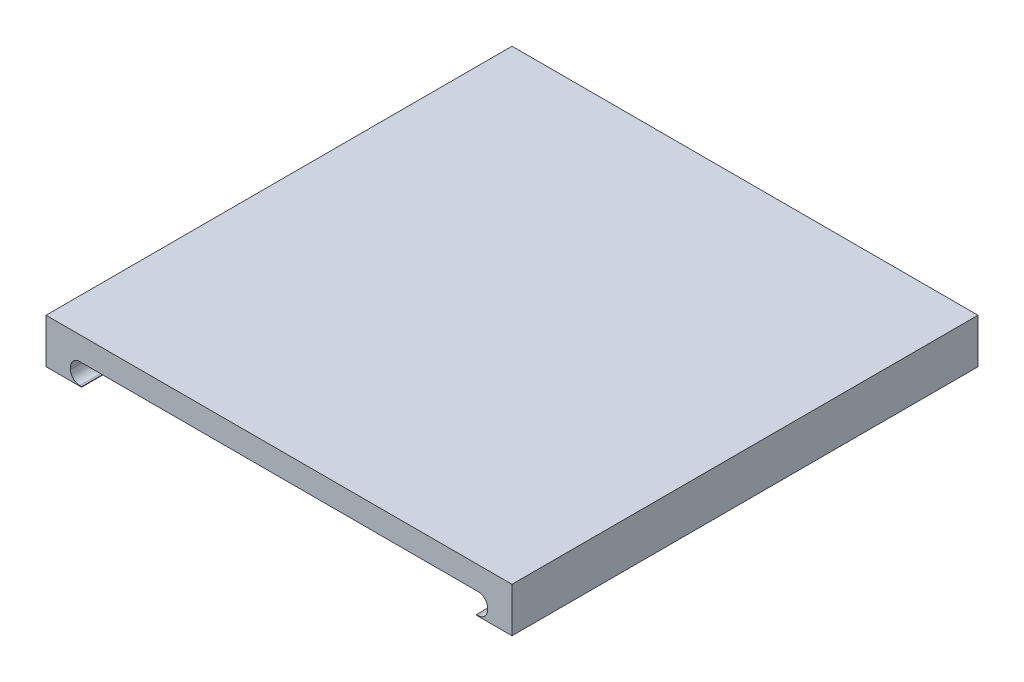
ISO-10303-21;
HEADER;
FILE_DESCRIPTION(('STEP AP214'),'2;1');
FILE_NAME('part.step','',(''),(''),'','','');
FILE_SCHEMA(('AUTOMOTIVE_DESIGN { 1 0 10303 214 1 1 1 1 }'));
ENDSEC;
DATA;
#1=APPLICATION_CONTEXT('core data for automotive mechanical design processes');
#2=APPLICATION_PROTOCOL_DEFINITION('international standard','automotive_design',2000,#1);
#3=PRODUCT_CONTEXT('',#1,'mechanical');
#4=PRODUCT('Part','Part','',(#3));
#5=PRODUCT_RELATED_PRODUCT_CATEGORY('part','',(#4));
#6=PRODUCT_DEFINITION_FORMATION('','',#4);
#7=PRODUCT_DEFINITION_CONTEXT('part definition',#1,'design');
#8=PRODUCT_DEFINITION('design','',#6,#7);
#9=PRODUCT_DEFINITION_SHAPE('','',#8);
#10=(LENGTH_UNIT() NAMED_UNIT(*) SI_UNIT(.MILLI.,.METRE.));
#11=(NAMED_UNIT(*) PLANE_ANGLE_UNIT() SI_UNIT($,.RADIAN.));
#12=(NAMED_UNIT(*) SI_UNIT($,.STERADIAN.) SOLID_ANGLE_UNIT());
#13=UNCERTAINTY_MEASURE_WITH_UNIT(LENGTH_MEASURE(1.E-05),#10,'distance_accuracy_value','');
#14=(GEOMETRIC_REPRESENTATION_CONTEXT(3) GLOBAL_UNCERTAINTY_ASSIGNED_CONTEXT((#13)) GLOBAL_UNIT_ASSIGNED_CONTEXT((#10,
#11,#12)) REPRESENTATION_CONTEXT('',''));
#15=CARTESIAN_POINT('',(0.,0.,0.));
#16=DIRECTION('',(0.,0.,1.));
#17=DIRECTION('',(1.,0.,0.));
#18=AXIS2_PLACEMENT_3D('',#15,#16,#17);
#19=CARTESIAN_POINT('',(25.,5.,25.));
#20=DIRECTION('',(-1.,0.,0.));
#21=DIRECTION('',(0.,0.,1.));
#22=AXIS2_PLACEMENT_3D('',#19,#20,#21);
#23=PLANE('',#22);
#24=DIRECTION('',(0.,-1.,0.));
#25=VECTOR('',#24,1.);
#26=CARTESIAN_POINT('',(25.,5.,25.));
#27=LINE('',#26,#25);
#28=CARTESIAN_POINT('',(25.,5.,25.));
#29=VERTEX_POINT('',#28);
#30=CARTESIAN_POINT('',(25.,0.211754728396015,25.));
#31=VERTEX_POINT('',#30);
#32=EDGE_CURVE('E159',#29,#31,#27,.T.);
#33=ORIENTED_EDGE('',*,*,#32,.T.);
#34=DIRECTION('',(0.,0.,1.));
#35=VECTOR('',#34,1.);
#36=CARTESIAN_POINT('',(25.,0.211754728396015,-25.));
#37=LINE('',#36,#35);
#38=CARTESIAN_POINT('',(25.,0.211754728396015,-25.));
#39=VERTEX_POINT('',#38);
#40=EDGE_CURVE('E146',#39,#31,#37,.T.);
#41=ORIENTED_EDGE('',*,*,#40,.F.);
#42=DIRECTION('',(0.,-1.,0.));
#43=VECTOR('',#42,1.);
#44=CARTESIAN_POINT('',(25.,5.,-25.));
#45=LINE('',#44,#43);
#46=CARTESIAN_POINT('',(25.,5.,-25.));
#47=VERTEX_POINT('',#46);
#48=EDGE_CURVE('E157',#47,#39,#45,.T.);
#49=ORIENTED_EDGE('',*,*,#48,.F.);
#50=DIRECTION('',(0.,0.,-1.));
#51=VECTOR('',#50,1.);
#52=CARTESIAN_POINT('',(25.,5.,25.));
#53=LINE('',#52,#51);
#54=EDGE_CURVE('E262',#29,#47,#53,.T.);
#55=ORIENTED_EDGE('',*,*,#54,.F.);
#56=EDGE_LOOP('',(#33,#41,#49,#55));
#57=FACE_BOUND('',#56,.T.);
#58=ADVANCED_FACE('F33',(#57),#23,.F.);
#59=CARTESIAN_POINT('',(-25.,5.,-25.));
#60=DIRECTION('',(0.,0.,1.));
#61=DIRECTION('',(1.,0.,0.));
#62=AXIS2_PLACEMENT_3D('',#59,#60,#61);
#63=PLANE('',#62);
#64=ORIENTED_EDGE('',*,*,#48,.T.);
#65=DIRECTION('',(-1.,0.,0.));
#66=VECTOR('',#65,1.);
#67=CARTESIAN_POINT('',(21.182376975,0.211754728396015,-25.));
#68=LINE('',#67,#66);
#69=CARTESIAN_POINT('',(21.182376975,0.211754728396015,-25.));
#70=VERTEX_POINT('',#69);
#71=EDGE_CURVE('E143',#39,#70,#68,.T.);
#72=ORIENTED_EDGE('',*,*,#71,.T.);
#73=DIRECTION('',(0.,-1.,0.));
#74=VECTOR('',#73,1.);
#75=CARTESIAN_POINT('',(21.182376975,2.5,-25.));
#76=LINE('',#75,#74);
#77=CARTESIAN_POINT('',(21.182376975,0.27848903671504,-25.));
#78=VERTEX_POINT('',#77);
#79=EDGE_CURVE('E258',#78,#70,#76,.T.);
#80=ORIENTED_EDGE('',*,*,#79,.F.);
#81=DIRECTION('',(-1.,0.,0.));
#82=VECTOR('',#81,1.);
#83=CARTESIAN_POINT('',(21.182376975,0.27848903671504,-25.));
#84=LINE('',#83,#82);
#85=CARTESIAN_POINT('',(21.3710197890908,0.27848903671504,-25.));
#86=VERTEX_POINT('',#85);
#87=EDGE_CURVE('E246',#86,#78,#84,.T.);
#88=ORIENTED_EDGE('',*,*,#87,.F.);
#89=CARTESIAN_POINT('',(21.3710197890908,1.27848903671504,-25.));
#90=DIRECTION('',(0.,0.,1.));
#91=DIRECTION('',(1.,0.,0.));
#92=AXIS2_PLACEMENT_3D('',#89,#90,#91);
#93=CIRCLE('',#92,1.);
#94=CARTESIAN_POINT('',(22.3710197890908,1.27848903671504,-25.));
#95=VERTEX_POINT('',#94);
#96=EDGE_CURVE('E188',#86,#95,#93,.T.);
#97=ORIENTED_EDGE('',*,*,#96,.T.);
#98=DIRECTION('',(0.,-1.,0.));
#99=VECTOR('',#98,1.);
#100=CARTESIAN_POINT('',(22.3710197890908,2.5,-25.));
#101=LINE('',#100,#99);
#102=CARTESIAN_POINT('',(22.3710197890908,1.5,-25.));
#103=VERTEX_POINT('',#102);
#104=EDGE_CURVE('E236',#103,#95,#101,.T.);
#105=ORIENTED_EDGE('',*,*,#104,.F.);
#106=CARTESIAN_POINT('',(21.3710197890908,1.5,-25.));
#107=DIRECTION('',(0.,0.,1.));
#108=DIRECTION('',(1.,0.,0.));
#109=AXIS2_PLACEMENT_3D('',#106,#107,#108);
#110=CIRCLE('',#109,1.);
#111=CARTESIAN_POINT('',(21.3710197890908,2.5,-25.));
#112=VERTEX_POINT('',#111);
#113=EDGE_CURVE('E178',#103,#112,#110,.T.);
#114=ORIENTED_EDGE('',*,*,#113,.T.);
#115=DIRECTION('',(1.,0.,0.));
#116=VECTOR('',#115,1.);
#117=CARTESIAN_POINT('',(21.182376975,2.5,-25.));
#118=LINE('',#117,#116);
#119=CARTESIAN_POINT('',(-21.371019785,2.5,-25.));
#120=VERTEX_POINT('',#119);
#121=EDGE_CURVE('E264',#120,#112,#118,.T.);
#122=ORIENTED_EDGE('',*,*,#121,.F.);
#123=CARTESIAN_POINT('',(-21.371019785,1.5,-25.));
#124=DIRECTION('',(0.,0.,1.));
#125=DIRECTION('',(1.,0.,0.));
#126=AXIS2_PLACEMENT_3D('',#123,#124,#125);
#127=CIRCLE('',#126,1.);
#128=CARTESIAN_POINT('',(-22.371019785,1.5,-25.));
#129=VERTEX_POINT('',#128);
#130=EDGE_CURVE('E199',#120,#129,#127,.T.);
#131=ORIENTED_EDGE('',*,*,#130,.T.);
#132=DIRECTION('',(0.,-1.,0.));
#133=VECTOR('',#132,1.);
#134=CARTESIAN_POINT('',(-22.371019785,2.5,-25.));
#135=LINE('',#134,#133);
#136=CARTESIAN_POINT('',(-22.371019785,1.27848904,-25.));
#137=VERTEX_POINT('',#136);
#138=EDGE_CURVE('E230',#129,#137,#135,.T.);
#139=ORIENTED_EDGE('',*,*,#138,.T.);
#140=CARTESIAN_POINT('',(-21.371019785,1.27848904,-25.));
#141=DIRECTION('',(0.,0.,1.));
#142=DIRECTION('',(1.,0.,0.));
#143=AXIS2_PLACEMENT_3D('',#140,#141,#142);
#144=CIRCLE('',#143,1.);
#145=CARTESIAN_POINT('',(-21.371019785,0.27848904,-25.));
#146=VERTEX_POINT('',#145);
#147=EDGE_CURVE('E11',#137,#146,#144,.T.);
#148=ORIENTED_EDGE('',*,*,#147,.T.);
#149=DIRECTION('',(1.,0.,0.));
#150=VECTOR('',#149,1.);
#151=CARTESIAN_POINT('',(-21.182376975,0.27848904,-25.));
#152=LINE('',#151,#150);
#153=CARTESIAN_POINT('',(-21.182376975,0.27848904,-25.));
#154=VERTEX_POINT('',#153);
#155=EDGE_CURVE('E228',#146,#154,#152,.T.);
#156=ORIENTED_EDGE('',*,*,#155,.T.);
#157=DIRECTION('',(0.,1.,0.));
#158=VECTOR('',#157,1.);
#159=CARTESIAN_POINT('',(-21.182376975,2.5,-25.));
#160=LINE('',#159,#158);
#161=CARTESIAN_POINT('',(-21.182376975,0.218182480219042,-25.));
#162=VERTEX_POINT('',#161);
#163=EDGE_CURVE('E254',#162,#154,#160,.T.);
#164=ORIENTED_EDGE('',*,*,#163,.F.);
#165=DIRECTION('',(-1.,0.,0.));
#166=VECTOR('',#165,1.);
#167=CARTESIAN_POINT('',(-21.182376975,0.218182480219043,-25.));
#168=LINE('',#167,#166);
#169=CARTESIAN_POINT('',(-25.,0.218182480219043,-25.));
#170=VERTEX_POINT('',#169);
#171=EDGE_CURVE('E56',#162,#170,#168,.T.);
#172=ORIENTED_EDGE('',*,*,#171,.T.);
#173=DIRECTION('',(0.,-1.,0.));
#174=VECTOR('',#173,1.);
#175=CARTESIAN_POINT('',(-25.,5.,-25.));
#176=LINE('',#175,#174);
#177=CARTESIAN_POINT('',(-25.,5.,-25.));
#178=VERTEX_POINT('',#177);
#179=EDGE_CURVE('E166',#178,#170,#176,.T.);
#180=ORIENTED_EDGE('',*,*,#179,.F.);
#181=DIRECTION('',(-1.,0.,0.));
#182=VECTOR('',#181,1.);
#183=CARTESIAN_POINT('',(-25.,5.,-25.));
#184=LINE('',#183,#182);
#185=EDGE_CURVE('E163',#47,#178,#184,.T.);
#186=ORIENTED_EDGE('',*,*,#185,.F.);
#187=EDGE_LOOP('',(#64,#72,#80,#88,#97,#105,#114,#122,#131,#139,#148,#156,#164,#172,#180,#186));
#188=FACE_BOUND('',#187,.T.);
#189=ADVANCED_FACE('F161',(#188),#63,.F.);
#190=CARTESIAN_POINT('',(-25.,5.,25.));
#191=DIRECTION('',(1.,0.,0.));
#192=DIRECTION('',(0.,0.,-1.));
#193=AXIS2_PLACEMENT_3D('',#190,#191,#192);
#194=PLANE('',#193);
#195=ORIENTED_EDGE('',*,*,#179,.T.);
#196=DIRECTION('',(0.,0.,1.));
#197=VECTOR('',#196,1.);
#198=CARTESIAN_POINT('',(-25.,0.218182480219043,-25.));
#199=LINE('',#198,#197);
#200=CARTESIAN_POINT('',(-25.,0.218182480219043,25.));
#201=VERTEX_POINT('',#200);
#202=EDGE_CURVE('E222',#170,#201,#199,.T.);
#203=ORIENTED_EDGE('',*,*,#202,.T.);
#204=DIRECTION('',(0.,-1.,0.));
#205=VECTOR('',#204,1.);
#206=CARTESIAN_POINT('',(-25.,5.,25.));
#207=LINE('',#206,#205);
#208=CARTESIAN_POINT('',(-25.,5.,25.));
#209=VERTEX_POINT('',#208);
#210=EDGE_CURVE('E172',#209,#201,#207,.T.);
#211=ORIENTED_EDGE('',*,*,#210,.F.);
#212=DIRECTION('',(0.,0.,1.));
#213=VECTOR('',#212,1.);
#214=CARTESIAN_POINT('',(-25.,5.,25.));
#215=LINE('',#214,#213);
#216=EDGE_CURVE('E269',#178,#209,#215,.T.);
#217=ORIENTED_EDGE('',*,*,#216,.F.);
#218=EDGE_LOOP('',(#195,#203,#211,#217));
#219=FACE_BOUND('',#218,.T.);
#220=ADVANCED_FACE('F282',(#219),#194,.F.);
#221=CARTESIAN_POINT('',(-25.,5.,25.));
#222=DIRECTION('',(0.,0.,-1.));
#223=DIRECTION('',(-1.,0.,0.));
#224=AXIS2_PLACEMENT_3D('',#221,#222,#223);
#225=PLANE('',#224);
#226=DIRECTION('',(0.,-1.,0.));
#227=VECTOR('',#226,1.);
#228=CARTESIAN_POINT('',(21.182376975,2.5,25.));
#229=LINE('',#228,#227);
#230=CARTESIAN_POINT('',(21.182376975,0.27848903671504,25.));
#231=VERTEX_POINT('',#230);
#232=CARTESIAN_POINT('',(21.182376975,0.211754728396015,25.));
#233=VERTEX_POINT('',#232);
#234=EDGE_CURVE('E260',#231,#233,#229,.T.);
#235=ORIENTED_EDGE('',*,*,#234,.T.);
#236=DIRECTION('',(-1.,0.,0.));
#237=VECTOR('',#236,1.);
#238=CARTESIAN_POINT('',(21.182376975,0.211754728396015,25.));
#239=LINE('',#238,#237);
#240=EDGE_CURVE('E48',#31,#233,#239,.T.);
#241=ORIENTED_EDGE('',*,*,#240,.F.);
#242=ORIENTED_EDGE('',*,*,#32,.F.);
#243=DIRECTION('',(1.,0.,0.));
#244=VECTOR('',#243,1.);
#245=CARTESIAN_POINT('',(-25.,5.,25.));
#246=LINE('',#245,#244);
#247=EDGE_CURVE('E271',#209,#29,#246,.T.);
#248=ORIENTED_EDGE('',*,*,#247,.F.);
#249=ORIENTED_EDGE('',*,*,#210,.T.);
#250=DIRECTION('',(-1.,0.,0.));
#251=VECTOR('',#250,1.);
#252=CARTESIAN_POINT('',(-21.182376975,0.218182480219043,25.));
#253=LINE('',#252,#251);
#254=CARTESIAN_POINT('',(-21.182376975,0.218182480219043,25.));
#255=VERTEX_POINT('',#254);
#256=EDGE_CURVE('E277',#255,#201,#253,.T.);
#257=ORIENTED_EDGE('',*,*,#256,.F.);
#258=DIRECTION('',(0.,1.,0.));
#259=VECTOR('',#258,1.);
#260=CARTESIAN_POINT('',(-21.182376975,2.5,25.));
#261=LINE('',#260,#259);
#262=CARTESIAN_POINT('',(-21.182376975,0.27848904,25.));
#263=VERTEX_POINT('',#262);
#264=EDGE_CURVE('E255',#255,#263,#261,.T.);
#265=ORIENTED_EDGE('',*,*,#264,.T.);
#266=DIRECTION('',(1.,0.,0.));
#267=VECTOR('',#266,1.);
#268=CARTESIAN_POINT('',(-21.182376975,0.27848904,25.));
#269=LINE('',#268,#267);
#270=CARTESIAN_POINT('',(-21.371019785,0.27848904,25.));
#271=VERTEX_POINT('',#270);
#272=EDGE_CURVE('E213',#271,#263,#269,.T.);
#273=ORIENTED_EDGE('',*,*,#272,.F.);
#274=CARTESIAN_POINT('',(-21.371019785,1.27848904,25.));
#275=DIRECTION('',(0.,0.,-1.));
#276=DIRECTION('',(-1.,0.,0.));
#277=AXIS2_PLACEMENT_3D('',#274,#275,#276);
#278=CIRCLE('',#277,1.);
#279=CARTESIAN_POINT('',(-22.371019785,1.27848904,25.));
#280=VERTEX_POINT('',#279);
#281=EDGE_CURVE('E41',#271,#280,#278,.T.);
#282=ORIENTED_EDGE('',*,*,#281,.T.);
#283=DIRECTION('',(0.,-1.,0.));
#284=VECTOR('',#283,1.);
#285=CARTESIAN_POINT('',(-22.371019785,2.5,25.));
#286=LINE('',#285,#284);
#287=CARTESIAN_POINT('',(-22.371019785,1.5,25.));
#288=VERTEX_POINT('',#287);
#289=EDGE_CURVE('E211',#288,#280,#286,.T.);
#290=ORIENTED_EDGE('',*,*,#289,.F.);
#291=CARTESIAN_POINT('',(-21.371019785,1.5,25.));
#292=DIRECTION('',(0.,0.,-1.));
#293=DIRECTION('',(-1.,0.,0.));
#294=AXIS2_PLACEMENT_3D('',#291,#292,#293);
#295=CIRCLE('',#294,1.);
#296=CARTESIAN_POINT('',(-21.371019785,2.5,25.));
#297=VERTEX_POINT('',#296);
#298=EDGE_CURVE('E197',#288,#297,#295,.T.);
#299=ORIENTED_EDGE('',*,*,#298,.T.);
#300=DIRECTION('',(1.,0.,0.));
#301=VECTOR('',#300,1.);
#302=CARTESIAN_POINT('',(21.182376975,2.5,25.));
#303=LINE('',#302,#301);
#304=CARTESIAN_POINT('',(21.3710197890908,2.5,25.));
#305=VERTEX_POINT('',#304);
#306=EDGE_CURVE('E257',#297,#305,#303,.T.);
#307=ORIENTED_EDGE('',*,*,#306,.T.);
#308=CARTESIAN_POINT('',(21.3710197890908,1.5,25.));
#309=DIRECTION('',(0.,0.,-1.));
#310=DIRECTION('',(-1.,0.,0.));
#311=AXIS2_PLACEMENT_3D('',#308,#309,#310);
#312=CIRCLE('',#311,1.);
#313=CARTESIAN_POINT('',(22.3710197890908,1.5,25.));
#314=VERTEX_POINT('',#313);
#315=EDGE_CURVE('E181',#305,#314,#312,.T.);
#316=ORIENTED_EDGE('',*,*,#315,.T.);
#317=DIRECTION('',(0.,-1.,0.));
#318=VECTOR('',#317,1.);
#319=CARTESIAN_POINT('',(22.3710197890908,2.5,25.));
#320=LINE('',#319,#318);
#321=CARTESIAN_POINT('',(22.3710197890908,1.27848903671504,25.));
#322=VERTEX_POINT('',#321);
#323=EDGE_CURVE('E242',#314,#322,#320,.T.);
#324=ORIENTED_EDGE('',*,*,#323,.T.);
#325=CARTESIAN_POINT('',(21.3710197890908,1.27848903671504,25.));
#326=DIRECTION('',(0.,0.,-1.));
#327=DIRECTION('',(-1.,0.,0.));
#328=AXIS2_PLACEMENT_3D('',#325,#326,#327);
#329=CIRCLE('',#328,1.);
#330=CARTESIAN_POINT('',(21.3710197890908,0.27848903671504,25.));
#331=VERTEX_POINT('',#330);
#332=EDGE_CURVE('E190',#322,#331,#329,.T.);
#333=ORIENTED_EDGE('',*,*,#332,.T.);
#334=DIRECTION('',(-1.,0.,0.));
#335=VECTOR('',#334,1.);
#336=CARTESIAN_POINT('',(21.182376975,0.27848903671504,25.));
#337=LINE('',#336,#335);
#338=EDGE_CURVE('E245',#331,#231,#337,.T.);
#339=ORIENTED_EDGE('',*,*,#338,.T.);
#340=EDGE_LOOP('',(#235,#241,#242,#248,#249,#257,#265,#273,#282,#290,#299,#307,#316,#324,#333,#339));
#341=FACE_BOUND('',#340,.T.);
#342=ADVANCED_FACE('F210',(#341),#225,.F.);
#343=CARTESIAN_POINT('',(0.,5.,0.));
#344=DIRECTION('',(0.,-1.,0.));
#345=DIRECTION('',(0.,0.,-1.));
#346=AXIS2_PLACEMENT_3D('',#343,#344,#345);
#347=PLANE('',#346);
#348=ORIENTED_EDGE('',*,*,#54,.T.);
#349=ORIENTED_EDGE('',*,*,#185,.T.);
#350=ORIENTED_EDGE('',*,*,#216,.T.);
#351=ORIENTED_EDGE('',*,*,#247,.T.);
#352=EDGE_LOOP('',(#348,#349,#350,#351));
#353=FACE_BOUND('',#352,.T.);
#354=ADVANCED_FACE('F328',(#353),#347,.F.);
#355=CARTESIAN_POINT('',(-21.182376975,2.5,25.));
#356=DIRECTION('',(-1.,0.,0.));
#357=DIRECTION('',(0.,0.,1.));
#358=AXIS2_PLACEMENT_3D('',#355,#356,#357);
#359=PLANE('',#358);
#360=ORIENTED_EDGE('',*,*,#264,.F.);
#361=DIRECTION('',(0.,0.,1.));
#362=VECTOR('',#361,1.);
#363=CARTESIAN_POINT('',(-21.182376975,0.218182480219043,-25.));
#364=LINE('',#363,#362);
#365=EDGE_CURVE('E283',#162,#255,#364,.T.);
#366=ORIENTED_EDGE('',*,*,#365,.F.);
#367=ORIENTED_EDGE('',*,*,#163,.T.);
#368=DIRECTION('',(0.,0.,1.));
#369=VECTOR('',#368,1.);
#370=CARTESIAN_POINT('',(-21.182376975,0.27848904,-25.));
#371=LINE('',#370,#369);
#372=EDGE_CURVE('E234',#154,#263,#371,.T.);
#373=ORIENTED_EDGE('',*,*,#372,.T.);
#374=EDGE_LOOP('',(#360,#366,#367,#373));
#375=FACE_BOUND('',#374,.T.);
#376=ADVANCED_FACE('F331',(#375),#359,.F.);
#377=CARTESIAN_POINT('',(21.182376975,2.5,25.));
#378=DIRECTION('',(1.,0.,0.));
#379=DIRECTION('',(0.,0.,-1.));
#380=AXIS2_PLACEMENT_3D('',#377,#378,#379);
#381=PLANE('',#380);
#382=ORIENTED_EDGE('',*,*,#79,.T.);
#383=DIRECTION('',(0.,0.,1.));
#384=VECTOR('',#383,1.);
#385=CARTESIAN_POINT('',(21.182376975,0.211754728396015,-25.));
#386=LINE('',#385,#384);
#387=EDGE_CURVE('E147',#70,#233,#386,.T.);
#388=ORIENTED_EDGE('',*,*,#387,.T.);
#389=ORIENTED_EDGE('',*,*,#234,.F.);
#390=DIRECTION('',(0.,0.,-1.));
#391=VECTOR('',#390,1.);
#392=CARTESIAN_POINT('',(21.182376975,0.27848903671504,25.));
#393=LINE('',#392,#391);
#394=EDGE_CURVE('E248',#231,#78,#393,.T.);
#395=ORIENTED_EDGE('',*,*,#394,.T.);
#396=EDGE_LOOP('',(#382,#388,#389,#395));
#397=FACE_BOUND('',#396,.T.);
#398=ADVANCED_FACE('F291',(#397),#381,.F.);
#399=CARTESIAN_POINT('',(21.182376975,2.5,25.));
#400=DIRECTION('',(0.,1.,0.));
#401=DIRECTION('',(0.,0.,1.));
#402=AXIS2_PLACEMENT_3D('',#399,#400,#401);
#403=PLANE('',#402);
#404=ORIENTED_EDGE('',*,*,#306,.F.);
#405=DIRECTION('',(0.,0.,1.));
#406=VECTOR('',#405,1.);
#407=CARTESIAN_POINT('',(-21.371019785,2.5,-25.));
#408=LINE('',#407,#406);
#409=EDGE_CURVE('E195',#297,#120,#408,.F.);
#410=ORIENTED_EDGE('',*,*,#409,.T.);
#411=ORIENTED_EDGE('',*,*,#121,.T.);
#412=DIRECTION('',(0.,0.,-1.));
#413=VECTOR('',#412,1.);
#414=CARTESIAN_POINT('',(21.3710197890908,2.5,25.));
#415=LINE('',#414,#413);
#416=EDGE_CURVE('E169',#112,#305,#415,.F.);
#417=ORIENTED_EDGE('',*,*,#416,.T.);
#418=EDGE_LOOP('',(#404,#410,#411,#417));
#419=FACE_BOUND('',#418,.T.);
#420=ADVANCED_FACE('F336',(#419),#403,.F.);
#421=CARTESIAN_POINT('',(21.182376975,0.27848903671504,25.));
#422=DIRECTION('',(0.,-1.,0.));
#423=DIRECTION('',(0.,0.,-1.));
#424=AXIS2_PLACEMENT_3D('',#421,#422,#423);
#425=PLANE('',#424);
#426=ORIENTED_EDGE('',*,*,#338,.F.);
#427=DIRECTION('',(0.,0.,-1.));
#428=VECTOR('',#427,1.);
#429=CARTESIAN_POINT('',(21.3710197890908,0.27848903671504,-25.));
#430=LINE('',#429,#428);
#431=EDGE_CURVE('E183',#331,#86,#430,.T.);
#432=ORIENTED_EDGE('',*,*,#431,.T.);
#433=ORIENTED_EDGE('',*,*,#87,.T.);
#434=ORIENTED_EDGE('',*,*,#394,.F.);
#435=EDGE_LOOP('',(#426,#432,#433,#434));
#436=FACE_BOUND('',#435,.T.);
#437=ADVANCED_FACE('F297',(#436),#425,.F.);
#438=CARTESIAN_POINT('',(22.3710197890908,2.5,25.));
#439=DIRECTION('',(1.,0.,0.));
#440=DIRECTION('',(0.,0.,-1.));
#441=AXIS2_PLACEMENT_3D('',#438,#439,#440);
#442=PLANE('',#441);
#443=ORIENTED_EDGE('',*,*,#104,.T.);
#444=DIRECTION('',(0.,0.,-1.));
#445=VECTOR('',#444,1.);
#446=CARTESIAN_POINT('',(22.3710197890908,1.27848903671504,25.));
#447=LINE('',#446,#445);
#448=EDGE_CURVE('E186',#95,#322,#447,.F.);
#449=ORIENTED_EDGE('',*,*,#448,.T.);
#450=ORIENTED_EDGE('',*,*,#323,.F.);
#451=DIRECTION('',(0.,0.,-1.));
#452=VECTOR('',#451,1.);
#453=CARTESIAN_POINT('',(22.3710197890908,1.5,-25.));
#454=LINE('',#453,#452);
#455=EDGE_CURVE('E165',#314,#103,#454,.T.);
#456=ORIENTED_EDGE('',*,*,#455,.T.);
#457=EDGE_LOOP('',(#443,#449,#450,#456));
#458=FACE_BOUND('',#457,.T.);
#459=ADVANCED_FACE('F303',(#458),#442,.F.);
#460=CARTESIAN_POINT('',(21.3710197890908,1.5,25.));
#461=DIRECTION('',(0.,0.,1.));
#462=DIRECTION('',(1.,0.,0.));
#463=AXIS2_PLACEMENT_3D('',#460,#461,#462);
#464=CYLINDRICAL_SURFACE('',#463,1.);
#465=ORIENTED_EDGE('',*,*,#315,.F.);
#466=ORIENTED_EDGE('',*,*,#416,.F.);
#467=ORIENTED_EDGE('',*,*,#113,.F.);
#468=ORIENTED_EDGE('',*,*,#455,.F.);
#469=EDGE_LOOP('',(#465,#466,#467,#468));
#470=FACE_BOUND('',#469,.T.);
#471=ADVANCED_FACE('F308',(#470),#464,.F.);
#472=CARTESIAN_POINT('',(21.3710197890908,1.27848903671504,25.));
#473=DIRECTION('',(0.,0.,1.));
#474=DIRECTION('',(1.,0.,0.));
#475=AXIS2_PLACEMENT_3D('',#472,#473,#474);
#476=CYLINDRICAL_SURFACE('',#475,1.);
#477=ORIENTED_EDGE('',*,*,#332,.F.);
#478=ORIENTED_EDGE('',*,*,#448,.F.);
#479=ORIENTED_EDGE('',*,*,#96,.F.);
#480=ORIENTED_EDGE('',*,*,#431,.F.);
#481=EDGE_LOOP('',(#477,#478,#479,#480));
#482=FACE_BOUND('',#481,.T.);
#483=ADVANCED_FACE('F306',(#482),#476,.F.);
#484=CARTESIAN_POINT('',(-21.182376975,0.27848904,-25.));
#485=DIRECTION('',(0.,-1.,0.));
#486=DIRECTION('',(1.,0.,0.));
#487=AXIS2_PLACEMENT_3D('',#484,#485,#486);
#488=PLANE('',#487);
#489=ORIENTED_EDGE('',*,*,#155,.F.);
#490=DIRECTION('',(0.,0.,1.));
#491=VECTOR('',#490,1.);
#492=CARTESIAN_POINT('',(-21.371019785,0.27848904,25.));
#493=LINE('',#492,#491);
#494=EDGE_CURVE('E201',#146,#271,#493,.T.);
#495=ORIENTED_EDGE('',*,*,#494,.T.);
#496=ORIENTED_EDGE('',*,*,#272,.T.);
#497=ORIENTED_EDGE('',*,*,#372,.F.);
#498=EDGE_LOOP('',(#489,#495,#496,#497));
#499=FACE_BOUND('',#498,.T.);
#500=ADVANCED_FACE('F232',(#499),#488,.F.);
#501=CARTESIAN_POINT('',(-22.371019785,2.5,-25.));
#502=DIRECTION('',(-1.,0.,0.));
#503=DIRECTION('',(0.,0.,1.));
#504=AXIS2_PLACEMENT_3D('',#501,#502,#503);
#505=PLANE('',#504);
#506=ORIENTED_EDGE('',*,*,#289,.T.);
#507=DIRECTION('',(0.,0.,1.));
#508=VECTOR('',#507,1.);
#509=CARTESIAN_POINT('',(-22.371019785,1.27848904,-25.));
#510=LINE('',#509,#508);
#511=EDGE_CURVE('E204',#280,#137,#510,.F.);
#512=ORIENTED_EDGE('',*,*,#511,.T.);
#513=ORIENTED_EDGE('',*,*,#138,.F.);
#514=DIRECTION('',(0.,0.,1.));
#515=VECTOR('',#514,1.);
#516=CARTESIAN_POINT('',(-22.371019785,1.5,25.));
#517=LINE('',#516,#515);
#518=EDGE_CURVE('E192',#129,#288,#517,.T.);
#519=ORIENTED_EDGE('',*,*,#518,.T.);
#520=EDGE_LOOP('',(#506,#512,#513,#519));
#521=FACE_BOUND('',#520,.T.);
#522=ADVANCED_FACE('F218',(#521),#505,.F.);
#523=CARTESIAN_POINT('',(-21.371019785,1.5,-25.));
#524=DIRECTION('',(0.,0.,-1.));
#525=DIRECTION('',(-1.,0.,0.));
#526=AXIS2_PLACEMENT_3D('',#523,#524,#525);
#527=CYLINDRICAL_SURFACE('',#526,1.);
#528=ORIENTED_EDGE('',*,*,#130,.F.);
#529=ORIENTED_EDGE('',*,*,#409,.F.);
#530=ORIENTED_EDGE('',*,*,#298,.F.);
#531=ORIENTED_EDGE('',*,*,#518,.F.);
#532=EDGE_LOOP('',(#528,#529,#530,#531));
#533=FACE_BOUND('',#532,.T.);
#534=ADVANCED_FACE('F347',(#533),#527,.F.);
#535=CARTESIAN_POINT('',(-21.371019785,1.27848904,-25.));
#536=DIRECTION('',(0.,0.,-1.));
#537=DIRECTION('',(-1.,0.,0.));
#538=AXIS2_PLACEMENT_3D('',#535,#536,#537);
#539=CYLINDRICAL_SURFACE('',#538,1.);
#540=ORIENTED_EDGE('',*,*,#147,.F.);
#541=ORIENTED_EDGE('',*,*,#511,.F.);
#542=ORIENTED_EDGE('',*,*,#281,.F.);
#543=ORIENTED_EDGE('',*,*,#494,.F.);
#544=EDGE_LOOP('',(#540,#541,#542,#543));
#545=FACE_BOUND('',#544,.T.);
#546=ADVANCED_FACE('F35',(#545),#539,.F.);
#547=CARTESIAN_POINT('',(-21.182376975,0.218182480219043,-25.));
#548=DIRECTION('',(0.,1.,0.));
#549=DIRECTION('',(0.,0.,1.));
#550=AXIS2_PLACEMENT_3D('',#547,#548,#549);
#551=PLANE('',#550);
#552=ORIENTED_EDGE('',*,*,#256,.T.);
#553=ORIENTED_EDGE('',*,*,#202,.F.);
#554=ORIENTED_EDGE('',*,*,#171,.F.);
#555=ORIENTED_EDGE('',*,*,#365,.T.);
#556=EDGE_LOOP('',(#552,#553,#554,#555));
#557=FACE_BOUND('',#556,.T.);
#558=ADVANCED_FACE('F349',(#557),#551,.F.);
#559=CARTESIAN_POINT('',(21.182376975,0.211754728396015,-25.));
#560=DIRECTION('',(0.,1.,0.));
#561=DIRECTION('',(0.,0.,1.));
#562=AXIS2_PLACEMENT_3D('',#559,#560,#561);
#563=PLANE('',#562);
#564=ORIENTED_EDGE('',*,*,#240,.T.);
#565=ORIENTED_EDGE('',*,*,#387,.F.);
#566=ORIENTED_EDGE('',*,*,#71,.F.);
#567=ORIENTED_EDGE('',*,*,#40,.T.);
#568=EDGE_LOOP('',(#564,#565,#566,#567));
#569=FACE_BOUND('',#568,.T.);
#570=ADVANCED_FACE('F145',(#569),#563,.F.);
#571=CLOSED_SHELL('',(#58,#189,#220,#342,#354,#376,#398,#420,#437,#459,#471,#483,#500,#522,#534,
#546,#558,#570));
#572=MANIFOLD_SOLID_BREP('B2',#571);
#573=ADVANCED_BREP_SHAPE_REPRESENTATION('',(#18,#572),#14);
#574=SHAPE_DEFINITION_REPRESENTATION(#9,#573);
ENDSEC;
END-ISO-10303-21;
